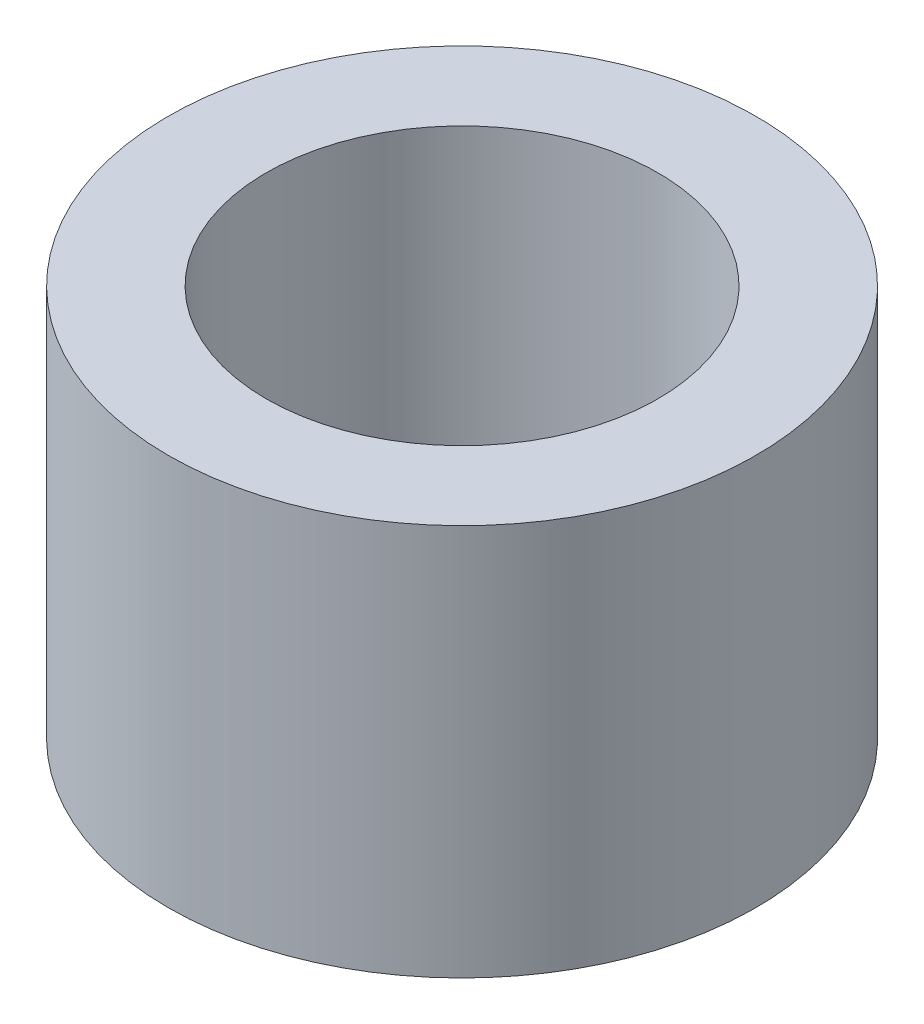
ISO-10303-21;
HEADER;
FILE_DESCRIPTION(('STEP AP214'),'2;1');
FILE_NAME('part.step','',(''),(''),'','','');
FILE_SCHEMA(('AUTOMOTIVE_DESIGN { 1 0 10303 214 1 1 1 1 }'));
ENDSEC;
DATA;
#1=APPLICATION_CONTEXT('core data for automotive mechanical design processes');
#2=APPLICATION_PROTOCOL_DEFINITION('international standard','automotive_design',2000,#1);
#3=PRODUCT_CONTEXT('',#1,'mechanical');
#4=PRODUCT('Part','Part','',(#3));
#5=PRODUCT_RELATED_PRODUCT_CATEGORY('part','',(#4));
#6=PRODUCT_DEFINITION_FORMATION('','',#4);
#7=PRODUCT_DEFINITION_CONTEXT('part definition',#1,'design');
#8=PRODUCT_DEFINITION('design','',#6,#7);
#9=PRODUCT_DEFINITION_SHAPE('','',#8);
#10=(LENGTH_UNIT() NAMED_UNIT(*) SI_UNIT(.MILLI.,.METRE.));
#11=(NAMED_UNIT(*) PLANE_ANGLE_UNIT() SI_UNIT($,.RADIAN.));
#12=(NAMED_UNIT(*) SI_UNIT($,.STERADIAN.) SOLID_ANGLE_UNIT());
#13=UNCERTAINTY_MEASURE_WITH_UNIT(LENGTH_MEASURE(1.E-05),#10,'distance_accuracy_value','');
#14=(GEOMETRIC_REPRESENTATION_CONTEXT(3) GLOBAL_UNCERTAINTY_ASSIGNED_CONTEXT((#13)) GLOBAL_UNIT_ASSIGNED_CONTEXT((#10,
#11,#12)) REPRESENTATION_CONTEXT('',''));
#15=CARTESIAN_POINT('',(0.,0.,0.));
#16=DIRECTION('',(0.,0.,1.));
#17=DIRECTION('',(1.,0.,0.));
#18=AXIS2_PLACEMENT_3D('',#15,#16,#17);
#19=CARTESIAN_POINT('',(0.,4.,0.));
#20=DIRECTION('',(0.,1.,0.));
#21=DIRECTION('',(0.,0.,1.));
#22=AXIS2_PLACEMENT_3D('',#19,#20,#21);
#23=PLANE('',#22);
#24=CARTESIAN_POINT('',(0.,4.,0.));
#25=DIRECTION('',(0.,1.,0.));
#26=DIRECTION('',(0.,0.,1.));
#27=AXIS2_PLACEMENT_3D('',#24,#25,#26);
#28=CIRCLE('',#27,3.);
#29=CARTESIAN_POINT('',(0.,4.,3.));
#30=VERTEX_POINT('',#29);
#31=EDGE_CURVE('E10',#30,#30,#28,.T.);
#32=ORIENTED_EDGE('',*,*,#31,.T.);
#33=EDGE_LOOP('',(#32));
#34=FACE_BOUND('',#33,.T.);
#35=CARTESIAN_POINT('',(0.,4.,0.));
#36=DIRECTION('',(0.,1.,0.));
#37=DIRECTION('',(0.,0.,1.));
#38=AXIS2_PLACEMENT_3D('',#35,#36,#37);
#39=CIRCLE('',#38,2.);
#40=CARTESIAN_POINT('',(0.,4.,2.));
#41=VERTEX_POINT('',#40);
#42=EDGE_CURVE('E48',#41,#41,#39,.T.);
#43=ORIENTED_EDGE('',*,*,#42,.F.);
#44=EDGE_LOOP('',(#43));
#45=FACE_BOUND('',#44,.T.);
#46=ADVANCED_FACE('F37',(#34,#45),#23,.T.);
#47=CARTESIAN_POINT('',(0.,0.,0.));
#48=DIRECTION('',(0.,1.,0.));
#49=DIRECTION('',(0.,0.,1.));
#50=AXIS2_PLACEMENT_3D('',#47,#48,#49);
#51=PLANE('',#50);
#52=CARTESIAN_POINT('',(0.,0.,0.));
#53=DIRECTION('',(0.,1.,0.));
#54=DIRECTION('',(0.,0.,1.));
#55=AXIS2_PLACEMENT_3D('',#52,#53,#54);
#56=CIRCLE('',#55,3.);
#57=CARTESIAN_POINT('',(0.,0.,3.));
#58=VERTEX_POINT('',#57);
#59=EDGE_CURVE('E41',#58,#58,#56,.T.);
#60=ORIENTED_EDGE('',*,*,#59,.F.);
#61=EDGE_LOOP('',(#60));
#62=FACE_BOUND('',#61,.T.);
#63=CARTESIAN_POINT('',(0.,0.,0.));
#64=DIRECTION('',(0.,1.,0.));
#65=DIRECTION('',(0.,0.,1.));
#66=AXIS2_PLACEMENT_3D('',#63,#64,#65);
#67=CIRCLE('',#66,2.);
#68=CARTESIAN_POINT('',(0.,0.,2.));
#69=VERTEX_POINT('',#68);
#70=EDGE_CURVE('E50',#69,#69,#67,.T.);
#71=ORIENTED_EDGE('',*,*,#70,.T.);
#72=EDGE_LOOP('',(#71));
#73=FACE_BOUND('',#72,.T.);
#74=ADVANCED_FACE('F60',(#62,#73),#51,.F.);
#75=CARTESIAN_POINT('',(0.,4.,0.));
#76=DIRECTION('',(0.,-1.,0.));
#77=DIRECTION('',(0.,0.,-1.));
#78=AXIS2_PLACEMENT_3D('',#75,#76,#77);
#79=CYLINDRICAL_SURFACE('',#78,3.);
#80=ORIENTED_EDGE('',*,*,#31,.F.);
#81=EDGE_LOOP('',(#80));
#82=FACE_BOUND('',#81,.T.);
#83=ORIENTED_EDGE('',*,*,#59,.T.);
#84=EDGE_LOOP('',(#83));
#85=FACE_BOUND('',#84,.T.);
#86=ADVANCED_FACE('F39',(#82,#85),#79,.T.);
#87=CARTESIAN_POINT('',(0.,4.,0.));
#88=DIRECTION('',(0.,-1.,0.));
#89=DIRECTION('',(0.,0.,-1.));
#90=AXIS2_PLACEMENT_3D('',#87,#88,#89);
#91=CYLINDRICAL_SURFACE('',#90,2.);
#92=ORIENTED_EDGE('',*,*,#42,.T.);
#93=EDGE_LOOP('',(#92));
#94=FACE_BOUND('',#93,.T.);
#95=ORIENTED_EDGE('',*,*,#70,.F.);
#96=EDGE_LOOP('',(#95));
#97=FACE_BOUND('',#96,.T.);
#98=ADVANCED_FACE('F56',(#94,#97),#91,.F.);
#99=CLOSED_SHELL('',(#46,#74,#86,#98));
#100=MANIFOLD_SOLID_BREP('B2',#99);
#101=ADVANCED_BREP_SHAPE_REPRESENTATION('',(#18,#100),#14);
#102=SHAPE_DEFINITION_REPRESENTATION(#9,#101);
ENDSEC;
END-ISO-10303-21;
